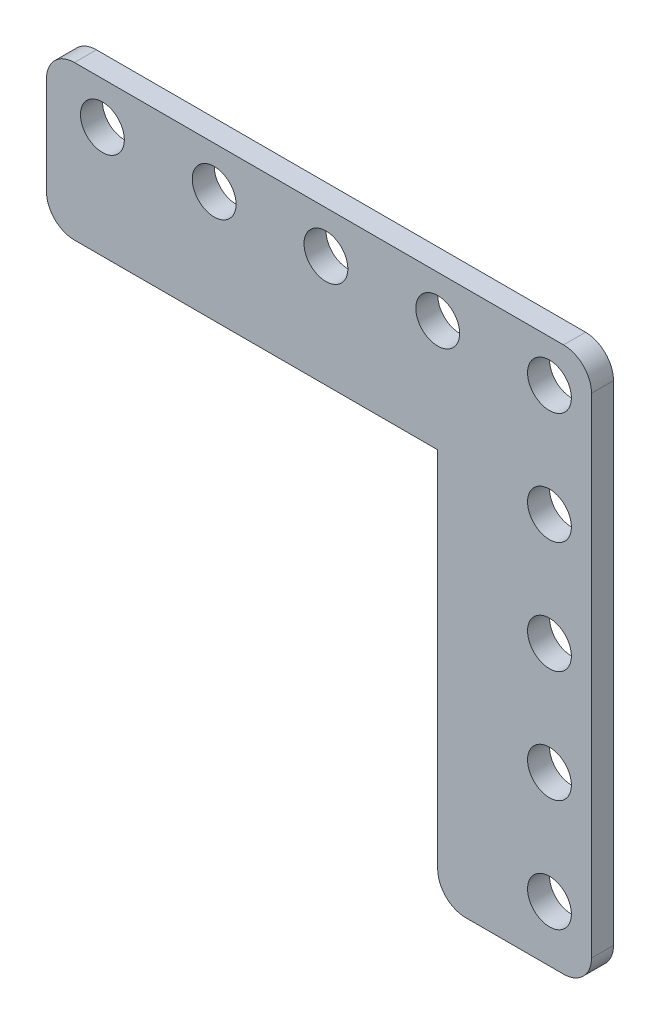
ISO-10303-21;
HEADER;
FILE_DESCRIPTION(('STEP AP214'),'2;1');
FILE_NAME('part.step','',(''),(''),'','','');
FILE_SCHEMA(('AUTOMOTIVE_DESIGN { 1 0 10303 214 1 1 1 1 }'));
ENDSEC;
DATA;
#1=APPLICATION_CONTEXT('core data for automotive mechanical design processes');
#2=APPLICATION_PROTOCOL_DEFINITION('international standard','automotive_design',2000,#1);
#3=PRODUCT_CONTEXT('',#1,'mechanical');
#4=PRODUCT('Part','Part','',(#3));
#5=PRODUCT_RELATED_PRODUCT_CATEGORY('part','',(#4));
#6=PRODUCT_DEFINITION_FORMATION('','',#4);
#7=PRODUCT_DEFINITION_CONTEXT('part definition',#1,'design');
#8=PRODUCT_DEFINITION('design','',#6,#7);
#9=PRODUCT_DEFINITION_SHAPE('','',#8);
#10=(LENGTH_UNIT() NAMED_UNIT(*) SI_UNIT(.MILLI.,.METRE.));
#11=(NAMED_UNIT(*) PLANE_ANGLE_UNIT() SI_UNIT($,.RADIAN.));
#12=(NAMED_UNIT(*) SI_UNIT($,.STERADIAN.) SOLID_ANGLE_UNIT());
#13=UNCERTAINTY_MEASURE_WITH_UNIT(LENGTH_MEASURE(1.E-05),#10,'distance_accuracy_value','');
#14=(GEOMETRIC_REPRESENTATION_CONTEXT(3) GLOBAL_UNCERTAINTY_ASSIGNED_CONTEXT((#13)) GLOBAL_UNIT_ASSIGNED_CONTEXT((#10,
#11,#12)) REPRESENTATION_CONTEXT('',''));
#15=CARTESIAN_POINT('',(0.,0.,0.));
#16=DIRECTION('',(0.,0.,1.));
#17=DIRECTION('',(1.,0.,0.));
#18=AXIS2_PLACEMENT_3D('',#15,#16,#17);
#19=CARTESIAN_POINT('',(-13.4873999999968,875.512599999967,2.50000000000015));
#20=DIRECTION('',(0.,0.,1.));
#21=DIRECTION('',(1.,0.,0.));
#22=AXIS2_PLACEMENT_3D('',#19,#20,#21);
#23=PLANE('',#22);
#24=CARTESIAN_POINT('',(-38.0999999999977,901.699999999967,2.50000000000015));
#25=DIRECTION('',(0.,0.,-1.));
#26=DIRECTION('',(1.,0.,0.));
#27=AXIS2_PLACEMENT_3D('',#24,#25,#26);
#28=CIRCLE('',#27,2.4892);
#29=CARTESIAN_POINT('',(-40.5891999999977,901.699999999967,2.50000000000015));
#30=VERTEX_POINT('',#29);
#31=EDGE_CURVE('E252',#30,#30,#28,.T.);
#32=ORIENTED_EDGE('',*,*,#31,.T.);
#33=EDGE_LOOP('',(#32));
#34=FACE_BOUND('',#33,.T.);
#35=CARTESIAN_POINT('',(12.7000000000032,901.699999999967,2.50000000000015));
#36=DIRECTION('',(0.,0.,-1.));
#37=DIRECTION('',(1.,0.,0.));
#38=AXIS2_PLACEMENT_3D('',#35,#36,#37);
#39=CIRCLE('',#38,2.4892);
#40=CARTESIAN_POINT('',(10.2108000000032,901.699999999967,2.50000000000015));
#41=VERTEX_POINT('',#40);
#42=EDGE_CURVE('E241',#41,#41,#39,.T.);
#43=ORIENTED_EDGE('',*,*,#42,.T.);
#44=EDGE_LOOP('',(#43));
#45=FACE_BOUND('',#44,.T.);
#46=CARTESIAN_POINT('',(12.700000000003,850.89999999997,2.50000000000015));
#47=DIRECTION('',(0.,0.,-1.));
#48=DIRECTION('',(1.,0.,0.));
#49=AXIS2_PLACEMENT_3D('',#46,#47,#48);
#50=CIRCLE('',#49,2.4892);
#51=CARTESIAN_POINT('',(10.210800000003,850.89999999997,2.50000000000015));
#52=VERTEX_POINT('',#51);
#53=EDGE_CURVE('E230',#52,#52,#50,.T.);
#54=ORIENTED_EDGE('',*,*,#53,.T.);
#55=EDGE_LOOP('',(#54));
#56=FACE_BOUND('',#55,.T.);
#57=CARTESIAN_POINT('',(12.7000000000032,888.999999999967,2.50000000000015));
#58=DIRECTION('',(0.,0.,-1.));
#59=DIRECTION('',(1.,0.,0.));
#60=AXIS2_PLACEMENT_3D('',#57,#58,#59);
#61=CIRCLE('',#60,2.4892);
#62=CARTESIAN_POINT('',(10.2108000000032,888.999999999967,2.50000000000015));
#63=VERTEX_POINT('',#62);
#64=EDGE_CURVE('E398',#63,#63,#61,.T.);
#65=ORIENTED_EDGE('',*,*,#64,.T.);
#66=EDGE_LOOP('',(#65));
#67=FACE_BOUND('',#66,.T.);
#68=CARTESIAN_POINT('',(-25.3999999999976,901.699999999967,2.50000000000015));
#69=DIRECTION('',(0.,0.,-1.));
#70=DIRECTION('',(1.,0.,0.));
#71=AXIS2_PLACEMENT_3D('',#68,#69,#70);
#72=CIRCLE('',#71,2.4892);
#73=CARTESIAN_POINT('',(-27.8891999999977,901.699999999967,2.50000000000015));
#74=VERTEX_POINT('',#73);
#75=EDGE_CURVE('E366',#74,#74,#72,.T.);
#76=ORIENTED_EDGE('',*,*,#75,.T.);
#77=EDGE_LOOP('',(#76));
#78=FACE_BOUND('',#77,.T.);
#79=CARTESIAN_POINT('',(3.29514193708748E-12,901.699999999967,2.50000000000015));
#80=DIRECTION('',(0.,0.,-1.));
#81=DIRECTION('',(1.,0.,0.));
#82=AXIS2_PLACEMENT_3D('',#79,#80,#81);
#83=CIRCLE('',#82,2.4892);
#84=CARTESIAN_POINT('',(-2.4891999999967,901.699999999967,2.50000000000015));
#85=VERTEX_POINT('',#84);
#86=EDGE_CURVE('E380',#85,#85,#83,.T.);
#87=ORIENTED_EDGE('',*,*,#86,.T.);
#88=EDGE_LOOP('',(#87));
#89=FACE_BOUND('',#88,.T.);
#90=CARTESIAN_POINT('',(12.7000000000031,863.59999999997,2.50000000000015));
#91=DIRECTION('',(0.,0.,-1.));
#92=DIRECTION('',(1.,0.,0.));
#93=AXIS2_PLACEMENT_3D('',#90,#91,#92);
#94=CIRCLE('',#93,2.4892);
#95=CARTESIAN_POINT('',(10.2108000000031,863.59999999997,2.50000000000015));
#96=VERTEX_POINT('',#95);
#97=EDGE_CURVE('E349',#96,#96,#94,.T.);
#98=ORIENTED_EDGE('',*,*,#97,.T.);
#99=EDGE_LOOP('',(#98));
#100=FACE_BOUND('',#99,.T.);
#101=CARTESIAN_POINT('',(12.7000000000031,876.299999999969,2.50000000000015));
#102=DIRECTION('',(0.,0.,-1.));
#103=DIRECTION('',(1.,0.,0.));
#104=AXIS2_PLACEMENT_3D('',#101,#102,#103);
#105=CIRCLE('',#104,2.4892);
#106=CARTESIAN_POINT('',(10.2108000000031,876.299999999969,2.50000000000015));
#107=VERTEX_POINT('',#106);
#108=EDGE_CURVE('E347',#107,#107,#105,.T.);
#109=ORIENTED_EDGE('',*,*,#108,.T.);
#110=EDGE_LOOP('',(#109));
#111=FACE_BOUND('',#110,.T.);
#112=CARTESIAN_POINT('',(-12.699999999997,901.699999999967,2.50000000000015));
#113=DIRECTION('',(0.,0.,-1.));
#114=DIRECTION('',(1.,0.,0.));
#115=AXIS2_PLACEMENT_3D('',#112,#113,#114);
#116=CIRCLE('',#115,2.4892);
#117=CARTESIAN_POINT('',(-15.189199999997,901.699999999967,2.50000000000015));
#118=VERTEX_POINT('',#117);
#119=EDGE_CURVE('E497',#118,#118,#116,.T.);
#120=ORIENTED_EDGE('',*,*,#119,.T.);
#121=EDGE_LOOP('',(#120));
#122=FACE_BOUND('',#121,.T.);
#123=CARTESIAN_POINT('',(14.3002000000032,847.724999999967,2.50000000000015));
#124=DIRECTION('',(0.,0.,-1.));
#125=DIRECTION('',(0.707106781186552,-0.707106781186543,0.));
#126=AXIS2_PLACEMENT_3D('',#123,#124,#125);
#127=CIRCLE('',#126,3.175);
#128=CARTESIAN_POINT('',(17.4752000000032,847.724999999967,2.50000000000015));
#129=VERTEX_POINT('',#128);
#130=CARTESIAN_POINT('',(14.3002000000032,844.549999999967,2.50000000000015));
#131=VERTEX_POINT('',#130);
#132=EDGE_CURVE('E279',#129,#131,#127,.T.);
#133=ORIENTED_EDGE('',*,*,#132,.F.);
#134=DIRECTION('',(0.,1.,0.));
#135=VECTOR('',#134,1.);
#136=CARTESIAN_POINT('',(17.4752000000032,844.549999999967,2.50000000000015));
#137=LINE('',#136,#135);
#138=CARTESIAN_POINT('',(17.4752000000032,903.300199999967,2.50000000000015));
#139=VERTEX_POINT('',#138);
#140=EDGE_CURVE('E198',#129,#139,#137,.T.);
#141=ORIENTED_EDGE('',*,*,#140,.T.);
#142=CARTESIAN_POINT('',(14.3002000000032,903.300199999967,2.50000000000015));
#143=DIRECTION('',(0.,0.,-1.));
#144=DIRECTION('',(0.707106781186552,0.707106781186543,0.));
#145=AXIS2_PLACEMENT_3D('',#142,#143,#144);
#146=CIRCLE('',#145,3.175);
#147=CARTESIAN_POINT('',(14.3002000000032,906.475199999967,2.50000000000015));
#148=VERTEX_POINT('',#147);
#149=EDGE_CURVE('E203',#148,#139,#146,.T.);
#150=ORIENTED_EDGE('',*,*,#149,.F.);
#151=DIRECTION('',(-1.,0.,0.));
#152=VECTOR('',#151,1.);
#153=CARTESIAN_POINT('',(17.4752000000032,906.475199999967,2.50000000000015));
#154=LINE('',#153,#152);
#155=CARTESIAN_POINT('',(-41.2749999999967,906.475199999967,2.50000000000015));
#156=VERTEX_POINT('',#155);
#157=EDGE_CURVE('E187',#148,#156,#154,.T.);
#158=ORIENTED_EDGE('',*,*,#157,.T.);
#159=CARTESIAN_POINT('',(-41.2749999999967,903.300199999967,2.50000000000015));
#160=DIRECTION('',(0.,0.,-1.));
#161=DIRECTION('',(-0.707106781186552,0.707106781186543,0.));
#162=AXIS2_PLACEMENT_3D('',#159,#160,#161);
#163=CIRCLE('',#162,3.175);
#164=CARTESIAN_POINT('',(-44.4499999999967,903.300199999967,2.50000000000015));
#165=VERTEX_POINT('',#164);
#166=EDGE_CURVE('E220',#165,#156,#163,.T.);
#167=ORIENTED_EDGE('',*,*,#166,.F.);
#168=DIRECTION('',(0.,-1.,0.));
#169=VECTOR('',#168,1.);
#170=CARTESIAN_POINT('',(-44.4499999999967,906.475199999967,2.50000000000015));
#171=LINE('',#170,#169);
#172=CARTESIAN_POINT('',(-44.4499999999967,892.174999999967,2.50000000000015));
#173=VERTEX_POINT('',#172);
#174=EDGE_CURVE('E324',#165,#173,#171,.T.);
#175=ORIENTED_EDGE('',*,*,#174,.T.);
#176=CARTESIAN_POINT('',(-41.2749999999967,892.174999999967,2.50000000000015));
#177=DIRECTION('',(0.,0.,-1.));
#178=DIRECTION('',(-0.707106781186552,-0.707106781186543,0.));
#179=AXIS2_PLACEMENT_3D('',#176,#177,#178);
#180=CIRCLE('',#179,3.175);
#181=CARTESIAN_POINT('',(-41.2749999999967,888.999999999967,2.50000000000015));
#182=VERTEX_POINT('',#181);
#183=EDGE_CURVE('E263',#182,#173,#180,.T.);
#184=ORIENTED_EDGE('',*,*,#183,.F.);
#185=DIRECTION('',(1.,0.,0.));
#186=VECTOR('',#185,1.);
#187=CARTESIAN_POINT('',(-44.4499999999967,888.999999999967,2.50000000000015));
#188=LINE('',#187,#186);
#189=CARTESIAN_POINT('',(3.22408766351145E-12,888.999999999967,2.50000000000015));
#190=VERTEX_POINT('',#189);
#191=EDGE_CURVE('E11',#182,#190,#188,.T.);
#192=ORIENTED_EDGE('',*,*,#191,.T.);
#193=DIRECTION('',(0.,-1.,0.));
#194=VECTOR('',#193,1.);
#195=CARTESIAN_POINT('',(3.22408766351145E-12,888.999999999967,2.50000000000015));
#196=LINE('',#195,#194);
#197=CARTESIAN_POINT('',(3.10656262619042E-12,847.724999999967,2.50000000000015));
#198=VERTEX_POINT('',#197);
#199=EDGE_CURVE('E197',#190,#198,#196,.T.);
#200=ORIENTED_EDGE('',*,*,#199,.T.);
#201=CARTESIAN_POINT('',(3.1750000000031,847.724999999967,2.50000000000015));
#202=DIRECTION('',(0.,0.,-1.));
#203=DIRECTION('',(-0.707106781186553,-0.707106781186542,0.));
#204=AXIS2_PLACEMENT_3D('',#201,#202,#203);
#205=CIRCLE('',#204,3.175);
#206=CARTESIAN_POINT('',(3.1750000000031,844.549999999967,2.50000000000015));
#207=VERTEX_POINT('',#206);
#208=EDGE_CURVE('E257',#207,#198,#205,.T.);
#209=ORIENTED_EDGE('',*,*,#208,.F.);
#210=DIRECTION('',(1.,0.,0.));
#211=VECTOR('',#210,1.);
#212=CARTESIAN_POINT('',(3.0975222387042E-12,844.549999999967,2.50000000000015));
#213=LINE('',#212,#211);
#214=EDGE_CURVE('E258',#207,#131,#213,.T.);
#215=ORIENTED_EDGE('',*,*,#214,.T.);
#216=EDGE_LOOP('',(#133,#141,#150,#158,#167,#175,#184,#192,#200,#209,#215));
#217=FACE_BOUND('',#216,.T.);
#218=ADVANCED_FACE('F17',(#34,#45,#56,#67,#78,#89,#100,#111,#122,#217),#23,.T.);
#219=CARTESIAN_POINT('',(-44.4499999999967,888.999999999967,1.53287466406063E-13));
#220=DIRECTION('',(0.,-1.,0.));
#221=DIRECTION('',(-1.,0.,0.));
#222=AXIS2_PLACEMENT_3D('',#219,#220,#221);
#223=PLANE('',#222);
#224=DIRECTION('',(0.,0.,1.));
#225=VECTOR('',#224,1.);
#226=CARTESIAN_POINT('',(-41.2749999999967,888.999999999967,1.53397238558369E-13));
#227=LINE('',#226,#225);
#228=CARTESIAN_POINT('',(-41.2749999999967,888.999999999967,1.5328673490841E-13));
#229=VERTEX_POINT('',#228);
#230=EDGE_CURVE('E320',#229,#182,#227,.T.);
#231=ORIENTED_EDGE('',*,*,#230,.F.);
#232=DIRECTION('',(1.,0.,0.));
#233=VECTOR('',#232,1.);
#234=CARTESIAN_POINT('',(-44.4499999999967,888.999999999967,1.53287466406063E-13));
#235=LINE('',#234,#233);
#236=CARTESIAN_POINT('',(3.22408766351145E-12,888.999999999967,1.53277225438917E-13));
#237=VERTEX_POINT('',#236);
#238=EDGE_CURVE('E297',#229,#237,#235,.T.);
#239=ORIENTED_EDGE('',*,*,#238,.T.);
#240=DIRECTION('',(0.,0.,1.));
#241=VECTOR('',#240,1.);
#242=CARTESIAN_POINT('',(3.22408766351145E-12,888.999999999967,1.53277225438917E-13));
#243=LINE('',#242,#241);
#244=EDGE_CURVE('E26',#237,#190,#243,.T.);
#245=ORIENTED_EDGE('',*,*,#244,.T.);
#246=ORIENTED_EDGE('',*,*,#191,.F.);
#247=EDGE_LOOP('',(#231,#239,#245,#246));
#248=FACE_BOUND('',#247,.T.);
#249=ADVANCED_FACE('F450',(#248),#223,.T.);
#250=CARTESIAN_POINT('',(3.22408766351145E-12,888.999999999967,1.53277225438917E-13));
#251=DIRECTION('',(-1.,0.,0.));
#252=DIRECTION('',(0.,0.,1.));
#253=AXIS2_PLACEMENT_3D('',#250,#251,#252);
#254=PLANE('',#253);
#255=DIRECTION('',(0.,0.,-1.));
#256=VECTOR('',#255,1.);
#257=CARTESIAN_POINT('',(3.1064040229012E-12,847.724999999967,1.52998008481745E-13));
#258=LINE('',#257,#256);
#259=CARTESIAN_POINT('',(3.10656262619042E-12,847.724999999967,1.52758679661312E-13));
#260=VERTEX_POINT('',#259);
#261=EDGE_CURVE('E268',#198,#260,#258,.T.);
#262=ORIENTED_EDGE('',*,*,#261,.F.);
#263=ORIENTED_EDGE('',*,*,#199,.F.);
#264=ORIENTED_EDGE('',*,*,#244,.F.);
#265=DIRECTION('',(0.,-1.,0.));
#266=VECTOR('',#265,1.);
#267=CARTESIAN_POINT('',(3.22408766351145E-12,888.999999999967,1.53277225438917E-13));
#268=LINE('',#267,#266);
#269=EDGE_CURVE('E273',#237,#260,#268,.T.);
#270=ORIENTED_EDGE('',*,*,#269,.T.);
#271=EDGE_LOOP('',(#262,#263,#264,#270));
#272=FACE_BOUND('',#271,.T.);
#273=ADVANCED_FACE('F449',(#272),#254,.T.);
#274=CARTESIAN_POINT('',(17.4752000000032,906.475199999967,1.53492743580445E-13));
#275=DIRECTION('',(0.,1.,0.));
#276=DIRECTION('',(1.,0.,0.));
#277=AXIS2_PLACEMENT_3D('',#274,#275,#276);
#278=PLANE('',#277);
#279=DIRECTION('',(0.,0.,-1.));
#280=VECTOR('',#279,1.);
#281=CARTESIAN_POINT('',(-41.2749999999967,906.475199999967,1.5349987714556E-13));
#282=LINE('',#281,#280);
#283=CARTESIAN_POINT('',(-41.2749999999967,906.475199999967,1.53506279213021E-13));
#284=VERTEX_POINT('',#283);
#285=EDGE_CURVE('E193',#156,#284,#282,.T.);
#286=ORIENTED_EDGE('',*,*,#285,.F.);
#287=ORIENTED_EDGE('',*,*,#157,.F.);
#288=DIRECTION('',(0.,0.,1.));
#289=VECTOR('',#288,1.);
#290=CARTESIAN_POINT('',(14.3002000000032,906.475199999967,1.53103754470967E-13));
#291=LINE('',#290,#289);
#292=CARTESIAN_POINT('',(14.3002000000032,906.475199999967,1.53493475078099E-13));
#293=VERTEX_POINT('',#292);
#294=EDGE_CURVE('E191',#293,#148,#291,.T.);
#295=ORIENTED_EDGE('',*,*,#294,.F.);
#296=DIRECTION('',(-1.,0.,0.));
#297=VECTOR('',#296,1.);
#298=CARTESIAN_POINT('',(17.4752000000032,906.475199999967,1.53492743580445E-13));
#299=LINE('',#298,#297);
#300=EDGE_CURVE('E307',#293,#284,#299,.T.);
#301=ORIENTED_EDGE('',*,*,#300,.T.);
#302=EDGE_LOOP('',(#286,#287,#295,#301));
#303=FACE_BOUND('',#302,.T.);
#304=ADVANCED_FACE('F189',(#303),#278,.T.);
#305=CARTESIAN_POINT('',(17.4752000000032,844.549999999967,1.52714765361489E-13));
#306=DIRECTION('',(1.,0.,0.));
#307=DIRECTION('',(0.,1.,0.));
#308=AXIS2_PLACEMENT_3D('',#305,#306,#307);
#309=PLANE('',#308);
#310=DIRECTION('',(0.,0.,1.));
#311=VECTOR('',#310,1.);
#312=CARTESIAN_POINT('',(17.4752000000032,847.724999999967,1.52716778443031E-13));
#313=LINE('',#312,#311);
#314=CARTESIAN_POINT('',(17.4752000000032,847.724999999967,1.52754653498228E-13));
#315=VERTEX_POINT('',#314);
#316=EDGE_CURVE('E288',#315,#129,#313,.T.);
#317=ORIENTED_EDGE('',*,*,#316,.F.);
#318=DIRECTION('',(0.,1.,0.));
#319=VECTOR('',#318,1.);
#320=CARTESIAN_POINT('',(17.4752000000032,844.549999999967,1.52714765361489E-13));
#321=LINE('',#320,#319);
#322=CARTESIAN_POINT('',(17.4752000000032,903.300199999967,1.53452855443706E-13));
#323=VERTEX_POINT('',#322);
#324=EDGE_CURVE('E312',#315,#323,#321,.T.);
#325=ORIENTED_EDGE('',*,*,#324,.T.);
#326=DIRECTION('',(0.,0.,-1.));
#327=VECTOR('',#326,1.);
#328=CARTESIAN_POINT('',(17.4752000000032,903.300199999967,1.53103754470967E-13));
#329=LINE('',#328,#327);
#330=EDGE_CURVE('E208',#139,#323,#329,.T.);
#331=ORIENTED_EDGE('',*,*,#330,.F.);
#332=ORIENTED_EDGE('',*,*,#140,.F.);
#333=EDGE_LOOP('',(#317,#325,#331,#332));
#334=FACE_BOUND('',#333,.T.);
#335=ADVANCED_FACE('F470',(#334),#309,.T.);
#336=CARTESIAN_POINT('',(14.3002000000032,903.300199999967,1.53103754470967E-13));
#337=DIRECTION('',(0.,0.,1.));
#338=DIRECTION('',(0.707106781186552,0.707106781186543,0.));
#339=AXIS2_PLACEMENT_3D('',#336,#337,#338);
#340=CYLINDRICAL_SURFACE('',#339,3.175);
#341=ORIENTED_EDGE('',*,*,#149,.T.);
#342=ORIENTED_EDGE('',*,*,#330,.T.);
#343=CARTESIAN_POINT('',(14.3002000000032,903.300199999967,1.53110888036082E-13));
#344=DIRECTION('',(0.,0.,1.));
#345=DIRECTION('',(0.707106781186552,0.707106781186543,0.));
#346=AXIS2_PLACEMENT_3D('',#343,#344,#345);
#347=CIRCLE('',#346,3.175);
#348=EDGE_CURVE('E205',#323,#293,#347,.T.);
#349=ORIENTED_EDGE('',*,*,#348,.T.);
#350=ORIENTED_EDGE('',*,*,#294,.T.);
#351=EDGE_LOOP('',(#341,#342,#349,#350));
#352=FACE_BOUND('',#351,.T.);
#353=ADVANCED_FACE('F202',(#352),#340,.T.);
#354=CARTESIAN_POINT('',(-41.2749999999967,903.300199999967,1.5349987714556E-13));
#355=DIRECTION('',(0.,0.,1.));
#356=DIRECTION('',(-0.707106781186552,0.707106781186543,0.));
#357=AXIS2_PLACEMENT_3D('',#354,#355,#356);
#358=CYLINDRICAL_SURFACE('',#357,3.175);
#359=ORIENTED_EDGE('',*,*,#166,.T.);
#360=ORIENTED_EDGE('',*,*,#285,.T.);
#361=CARTESIAN_POINT('',(-41.2749999999967,903.300199999967,1.53110888036082E-13));
#362=DIRECTION('',(0.,0.,1.));
#363=DIRECTION('',(-0.707106781186552,0.707106781186543,0.));
#364=AXIS2_PLACEMENT_3D('',#361,#362,#363);
#365=CIRCLE('',#364,3.175);
#366=CARTESIAN_POINT('',(-44.4499999999967,903.300199999967,1.53467122573935E-13));
#367=VERTEX_POINT('',#366);
#368=EDGE_CURVE('E302',#284,#367,#365,.T.);
#369=ORIENTED_EDGE('',*,*,#368,.T.);
#370=DIRECTION('',(0.,0.,1.));
#371=VECTOR('',#370,1.);
#372=CARTESIAN_POINT('',(-44.4499999999967,903.300199999967,1.5349987714556E-13));
#373=LINE('',#372,#371);
#374=EDGE_CURVE('E327',#367,#165,#373,.T.);
#375=ORIENTED_EDGE('',*,*,#374,.T.);
#376=EDGE_LOOP('',(#359,#360,#369,#375));
#377=FACE_BOUND('',#376,.T.);
#378=ADVANCED_FACE('F460',(#377),#358,.T.);
#379=CARTESIAN_POINT('',(-44.4499999999967,906.475199999967,1.53507010710674E-13));
#380=DIRECTION('',(-1.,0.,0.));
#381=DIRECTION('',(0.,0.,1.));
#382=AXIS2_PLACEMENT_3D('',#379,#380,#381);
#383=PLANE('',#382);
#384=DIRECTION('',(0.,0.,-1.));
#385=VECTOR('',#384,1.);
#386=CARTESIAN_POINT('',(-44.4499999999967,892.174999999967,1.53397238558369E-13));
#387=LINE('',#386,#385);
#388=CARTESIAN_POINT('',(-44.4499999999967,892.174999999967,1.53327354542802E-13));
#389=VERTEX_POINT('',#388);
#390=EDGE_CURVE('E267',#173,#389,#387,.T.);
#391=ORIENTED_EDGE('',*,*,#390,.F.);
#392=ORIENTED_EDGE('',*,*,#174,.F.);
#393=ORIENTED_EDGE('',*,*,#374,.F.);
#394=DIRECTION('',(0.,-1.,0.));
#395=VECTOR('',#394,1.);
#396=CARTESIAN_POINT('',(-44.4499999999967,906.475199999967,1.53507010710674E-13));
#397=LINE('',#396,#395);
#398=EDGE_CURVE('E298',#367,#389,#397,.T.);
#399=ORIENTED_EDGE('',*,*,#398,.T.);
#400=EDGE_LOOP('',(#391,#392,#393,#399));
#401=FACE_BOUND('',#400,.T.);
#402=ADVANCED_FACE('F457',(#401),#383,.T.);
#403=CARTESIAN_POINT('',(-41.2749999999967,892.174999999967,1.53397238558369E-13));
#404=DIRECTION('',(0.,0.,1.));
#405=DIRECTION('',(-0.707106781186552,-0.707106781186543,0.));
#406=AXIS2_PLACEMENT_3D('',#403,#404,#405);
#407=CYLINDRICAL_SURFACE('',#406,3.175);
#408=ORIENTED_EDGE('',*,*,#183,.T.);
#409=ORIENTED_EDGE('',*,*,#390,.T.);
#410=CARTESIAN_POINT('',(-41.2749999999967,892.174999999967,1.53110888036082E-13));
#411=DIRECTION('',(0.,0.,1.));
#412=DIRECTION('',(-0.707106781186552,-0.707106781186543,0.));
#413=AXIS2_PLACEMENT_3D('',#410,#411,#412);
#414=CIRCLE('',#413,3.175);
#415=EDGE_CURVE('E303',#389,#229,#414,.T.);
#416=ORIENTED_EDGE('',*,*,#415,.T.);
#417=ORIENTED_EDGE('',*,*,#230,.T.);
#418=EDGE_LOOP('',(#408,#409,#416,#417));
#419=FACE_BOUND('',#418,.T.);
#420=ADVANCED_FACE('F452',(#419),#407,.T.);
#421=CARTESIAN_POINT('',(3.1750000000031,847.724999999967,1.52998008481745E-13));
#422=DIRECTION('',(0.,0.,1.));
#423=DIRECTION('',(-0.707106781186553,-0.707106781186542,0.));
#424=AXIS2_PLACEMENT_3D('',#421,#422,#423);
#425=CYLINDRICAL_SURFACE('',#424,3.175);
#426=ORIENTED_EDGE('',*,*,#208,.T.);
#427=ORIENTED_EDGE('',*,*,#261,.T.);
#428=CARTESIAN_POINT('',(3.1750000000031,847.724999999967,1.53110888036082E-13));
#429=DIRECTION('',(0.,0.,1.));
#430=DIRECTION('',(-0.707106781186553,-0.707106781186542,0.));
#431=AXIS2_PLACEMENT_3D('',#428,#429,#430);
#432=CIRCLE('',#431,3.175);
#433=CARTESIAN_POINT('',(3.1750000000031,844.549999999967,1.52718060026919E-13));
#434=VERTEX_POINT('',#433);
#435=EDGE_CURVE('E269',#260,#434,#432,.T.);
#436=ORIENTED_EDGE('',*,*,#435,.T.);
#437=DIRECTION('',(0.,0.,1.));
#438=VECTOR('',#437,1.);
#439=CARTESIAN_POINT('',(3.1750000000031,844.549999999967,1.52998008481745E-13));
#440=LINE('',#439,#438);
#441=EDGE_CURVE('E253',#434,#207,#440,.T.);
#442=ORIENTED_EDGE('',*,*,#441,.T.);
#443=EDGE_LOOP('',(#426,#427,#436,#442));
#444=FACE_BOUND('',#443,.T.);
#445=ADVANCED_FACE('F444',(#444),#425,.T.);
#446=CARTESIAN_POINT('',(3.0975222387042E-12,844.549999999967,1.52718791524573E-13));
#447=DIRECTION('',(0.,-1.,0.));
#448=DIRECTION('',(0.,0.,-1.));
#449=AXIS2_PLACEMENT_3D('',#446,#447,#448);
#450=PLANE('',#449);
#451=DIRECTION('',(0.,0.,-1.));
#452=VECTOR('',#451,1.);
#453=CARTESIAN_POINT('',(14.3002000000032,844.549999999967,1.52716778443031E-13));
#454=LINE('',#453,#452);
#455=CARTESIAN_POINT('',(14.3002000000032,844.549999999967,1.52715496859142E-13));
#456=VERTEX_POINT('',#455);
#457=EDGE_CURVE('E283',#131,#456,#454,.T.);
#458=ORIENTED_EDGE('',*,*,#457,.F.);
#459=ORIENTED_EDGE('',*,*,#214,.F.);
#460=ORIENTED_EDGE('',*,*,#441,.F.);
#461=DIRECTION('',(1.,0.,0.));
#462=VECTOR('',#461,1.);
#463=CARTESIAN_POINT('',(3.0975222387042E-12,844.549999999967,1.52718791524573E-13));
#464=LINE('',#463,#462);
#465=EDGE_CURVE('E274',#434,#456,#464,.T.);
#466=ORIENTED_EDGE('',*,*,#465,.T.);
#467=EDGE_LOOP('',(#458,#459,#460,#466));
#468=FACE_BOUND('',#467,.T.);
#469=ADVANCED_FACE('F419',(#468),#450,.T.);
#470=CARTESIAN_POINT('',(-13.4873999999968,875.512599999967,1.53110888036082E-13));
#471=DIRECTION('',(0.,0.,1.));
#472=DIRECTION('',(0.,-1.,0.));
#473=AXIS2_PLACEMENT_3D('',#470,#471,#472);
#474=PLANE('',#473);
#475=CARTESIAN_POINT('',(-38.0999999999977,901.699999999967,1.53210777398272E-13));
#476=DIRECTION('',(0.,0.,1.));
#477=DIRECTION('',(1.,0.,0.));
#478=AXIS2_PLACEMENT_3D('',#475,#476,#477);
#479=CIRCLE('',#478,2.4892);
#480=CARTESIAN_POINT('',(-40.5891999999977,901.699999999967,1.53210777398272E-13));
#481=VERTEX_POINT('',#480);
#482=EDGE_CURVE('E278',#481,#481,#479,.T.);
#483=ORIENTED_EDGE('',*,*,#482,.T.);
#484=EDGE_LOOP('',(#483));
#485=FACE_BOUND('',#484,.T.);
#486=CARTESIAN_POINT('',(12.7000000000032,901.699999999967,1.53210777398272E-13));
#487=DIRECTION('',(0.,0.,1.));
#488=DIRECTION('',(1.,0.,0.));
#489=AXIS2_PLACEMENT_3D('',#486,#487,#488);
#490=CIRCLE('',#489,2.4892);
#491=CARTESIAN_POINT('',(10.2108000000032,901.699999999967,1.53210777398272E-13));
#492=VERTEX_POINT('',#491);
#493=EDGE_CURVE('E249',#492,#492,#490,.T.);
#494=ORIENTED_EDGE('',*,*,#493,.T.);
#495=EDGE_LOOP('',(#494));
#496=FACE_BOUND('',#495,.T.);
#497=CARTESIAN_POINT('',(12.700000000003,850.89999999997,1.53210777398272E-13));
#498=DIRECTION('',(0.,0.,1.));
#499=DIRECTION('',(1.,0.,0.));
#500=AXIS2_PLACEMENT_3D('',#497,#498,#499);
#501=CIRCLE('',#500,2.4892);
#502=CARTESIAN_POINT('',(10.210800000003,850.89999999997,1.53210777398272E-13));
#503=VERTEX_POINT('',#502);
#504=EDGE_CURVE('E238',#503,#503,#501,.T.);
#505=ORIENTED_EDGE('',*,*,#504,.T.);
#506=EDGE_LOOP('',(#505));
#507=FACE_BOUND('',#506,.T.);
#508=CARTESIAN_POINT('',(12.7000000000032,888.999999999967,1.53210777398272E-13));
#509=DIRECTION('',(0.,0.,1.));
#510=DIRECTION('',(1.,0.,0.));
#511=AXIS2_PLACEMENT_3D('',#508,#509,#510);
#512=CIRCLE('',#511,2.4892);
#513=CARTESIAN_POINT('',(10.2108000000032,888.999999999967,1.53210777398272E-13));
#514=VERTEX_POINT('',#513);
#515=EDGE_CURVE('E226',#514,#514,#512,.T.);
#516=ORIENTED_EDGE('',*,*,#515,.T.);
#517=EDGE_LOOP('',(#516));
#518=FACE_BOUND('',#517,.T.);
#519=CARTESIAN_POINT('',(-25.3999999999976,901.699999999967,1.53210777398272E-13));
#520=DIRECTION('',(0.,0.,1.));
#521=DIRECTION('',(1.,0.,0.));
#522=AXIS2_PLACEMENT_3D('',#519,#520,#521);
#523=CIRCLE('',#522,2.4892);
#524=CARTESIAN_POINT('',(-27.8891999999977,901.699999999967,1.53210777398272E-13));
#525=VERTEX_POINT('',#524);
#526=EDGE_CURVE('E396',#525,#525,#523,.T.);
#527=ORIENTED_EDGE('',*,*,#526,.T.);
#528=EDGE_LOOP('',(#527));
#529=FACE_BOUND('',#528,.T.);
#530=CARTESIAN_POINT('',(3.29514193708748E-12,901.699999999967,1.53210777398272E-13));
#531=DIRECTION('',(0.,0.,1.));
#532=DIRECTION('',(1.,0.,0.));
#533=AXIS2_PLACEMENT_3D('',#530,#531,#532);
#534=CIRCLE('',#533,2.4892);
#535=CARTESIAN_POINT('',(-2.4891999999967,901.699999999967,1.53210777398272E-13));
#536=VERTEX_POINT('',#535);
#537=EDGE_CURVE('E371',#536,#536,#534,.T.);
#538=ORIENTED_EDGE('',*,*,#537,.T.);
#539=EDGE_LOOP('',(#538));
#540=FACE_BOUND('',#539,.T.);
#541=CARTESIAN_POINT('',(12.7000000000031,863.59999999997,1.53210777398272E-13));
#542=DIRECTION('',(0.,0.,1.));
#543=DIRECTION('',(1.,0.,0.));
#544=AXIS2_PLACEMENT_3D('',#541,#542,#543);
#545=CIRCLE('',#544,2.4892);
#546=CARTESIAN_POINT('',(10.2108000000031,863.59999999997,1.53210777398272E-13));
#547=VERTEX_POINT('',#546);
#548=EDGE_CURVE('E375',#547,#547,#545,.T.);
#549=ORIENTED_EDGE('',*,*,#548,.T.);
#550=EDGE_LOOP('',(#549));
#551=FACE_BOUND('',#550,.T.);
#552=CARTESIAN_POINT('',(12.7000000000031,876.299999999969,1.53210777398272E-13));
#553=DIRECTION('',(0.,0.,1.));
#554=DIRECTION('',(1.,0.,0.));
#555=AXIS2_PLACEMENT_3D('',#552,#553,#554);
#556=CIRCLE('',#555,2.4892);
#557=CARTESIAN_POINT('',(10.2108000000031,876.299999999969,1.53210777398272E-13));
#558=VERTEX_POINT('',#557);
#559=EDGE_CURVE('E354',#558,#558,#556,.T.);
#560=ORIENTED_EDGE('',*,*,#559,.T.);
#561=EDGE_LOOP('',(#560));
#562=FACE_BOUND('',#561,.T.);
#563=CARTESIAN_POINT('',(-12.699999999997,901.699999999967,1.53210777398272E-13));
#564=DIRECTION('',(0.,0.,1.));
#565=DIRECTION('',(1.,0.,0.));
#566=AXIS2_PLACEMENT_3D('',#563,#564,#565);
#567=CIRCLE('',#566,2.4892);
#568=CARTESIAN_POINT('',(-15.189199999997,901.699999999967,1.53210777398272E-13));
#569=VERTEX_POINT('',#568);
#570=EDGE_CURVE('E432',#569,#569,#567,.T.);
#571=ORIENTED_EDGE('',*,*,#570,.T.);
#572=EDGE_LOOP('',(#571));
#573=FACE_BOUND('',#572,.T.);
#574=CARTESIAN_POINT('',(14.3002000000032,847.724999999967,1.53110888036082E-13));
#575=DIRECTION('',(0.,0.,1.));
#576=DIRECTION('',(0.707106781186552,-0.707106781186543,0.));
#577=AXIS2_PLACEMENT_3D('',#574,#575,#576);
#578=CIRCLE('',#577,3.175);
#579=EDGE_CURVE('E287',#456,#315,#578,.T.);
#580=ORIENTED_EDGE('',*,*,#579,.F.);
#581=ORIENTED_EDGE('',*,*,#465,.F.);
#582=ORIENTED_EDGE('',*,*,#435,.F.);
#583=ORIENTED_EDGE('',*,*,#269,.F.);
#584=ORIENTED_EDGE('',*,*,#238,.F.);
#585=ORIENTED_EDGE('',*,*,#415,.F.);
#586=ORIENTED_EDGE('',*,*,#398,.F.);
#587=ORIENTED_EDGE('',*,*,#368,.F.);
#588=ORIENTED_EDGE('',*,*,#300,.F.);
#589=ORIENTED_EDGE('',*,*,#348,.F.);
#590=ORIENTED_EDGE('',*,*,#324,.F.);
#591=EDGE_LOOP('',(#580,#581,#582,#583,#584,#585,#586,#587,#588,#589,#590));
#592=FACE_BOUND('',#591,.T.);
#593=ADVANCED_FACE('F415',(#485,#496,#507,#518,#529,#540,#551,#562,#573,#592),#474,.F.);
#594=CARTESIAN_POINT('',(14.3002000000032,847.724999999967,1.52716778443031E-13));
#595=DIRECTION('',(0.,0.,1.));
#596=DIRECTION('',(0.707106781186552,-0.707106781186543,0.));
#597=AXIS2_PLACEMENT_3D('',#594,#595,#596);
#598=CYLINDRICAL_SURFACE('',#597,3.175);
#599=ORIENTED_EDGE('',*,*,#132,.T.);
#600=ORIENTED_EDGE('',*,*,#457,.T.);
#601=ORIENTED_EDGE('',*,*,#579,.T.);
#602=ORIENTED_EDGE('',*,*,#316,.T.);
#603=EDGE_LOOP('',(#599,#600,#601,#602));
#604=FACE_BOUND('',#603,.T.);
#605=ADVANCED_FACE('F418',(#604),#598,.T.);
#606=CARTESIAN_POINT('',(-38.0999999999977,901.699999999967,2.50000000000015));
#607=DIRECTION('',(0.,0.,-1.));
#608=DIRECTION('',(1.,0.,0.));
#609=AXIS2_PLACEMENT_3D('',#606,#607,#608);
#610=CYLINDRICAL_SURFACE('',#609,2.4892);
#611=ORIENTED_EDGE('',*,*,#31,.F.);
#612=DIRECTION('',(0.,0.,-1.));
#613=VECTOR('',#612,1.);
#614=CARTESIAN_POINT('',(-40.5891999999977,901.699999999967,2.50000000000015));
#615=LINE('',#614,#613);
#616=EDGE_CURVE('E261',#30,#481,#615,.T.);
#617=ORIENTED_EDGE('',*,*,#616,.T.);
#618=ORIENTED_EDGE('',*,*,#482,.F.);
#619=ORIENTED_EDGE('',*,*,#616,.F.);
#620=EDGE_LOOP('',(#611,#617,#618,#619));
#621=FACE_BOUND('',#620,.T.);
#622=ADVANCED_FACE('F724',(#621),#610,.F.);
#623=CARTESIAN_POINT('',(12.7000000000032,901.699999999967,2.50000000000015));
#624=DIRECTION('',(0.,0.,-1.));
#625=DIRECTION('',(1.,0.,0.));
#626=AXIS2_PLACEMENT_3D('',#623,#624,#625);
#627=CYLINDRICAL_SURFACE('',#626,2.4892);
#628=ORIENTED_EDGE('',*,*,#42,.F.);
#629=DIRECTION('',(0.,0.,-1.));
#630=VECTOR('',#629,1.);
#631=CARTESIAN_POINT('',(10.2108000000032,901.699999999967,2.50000000000015));
#632=LINE('',#631,#630);
#633=EDGE_CURVE('E245',#41,#492,#632,.T.);
#634=ORIENTED_EDGE('',*,*,#633,.T.);
#635=ORIENTED_EDGE('',*,*,#493,.F.);
#636=ORIENTED_EDGE('',*,*,#633,.F.);
#637=EDGE_LOOP('',(#628,#634,#635,#636));
#638=FACE_BOUND('',#637,.T.);
#639=ADVANCED_FACE('F718',(#638),#627,.F.);
#640=CARTESIAN_POINT('',(12.700000000003,850.89999999997,2.50000000000015));
#641=DIRECTION('',(0.,0.,-1.));
#642=DIRECTION('',(1.,0.,0.));
#643=AXIS2_PLACEMENT_3D('',#640,#641,#642);
#644=CYLINDRICAL_SURFACE('',#643,2.4892);
#645=ORIENTED_EDGE('',*,*,#53,.F.);
#646=DIRECTION('',(0.,0.,-1.));
#647=VECTOR('',#646,1.);
#648=CARTESIAN_POINT('',(10.210800000003,850.89999999997,2.50000000000015));
#649=LINE('',#648,#647);
#650=EDGE_CURVE('E234',#52,#503,#649,.T.);
#651=ORIENTED_EDGE('',*,*,#650,.T.);
#652=ORIENTED_EDGE('',*,*,#504,.F.);
#653=ORIENTED_EDGE('',*,*,#650,.F.);
#654=EDGE_LOOP('',(#645,#651,#652,#653));
#655=FACE_BOUND('',#654,.T.);
#656=ADVANCED_FACE('F723',(#655),#644,.F.);
#657=CARTESIAN_POINT('',(12.7000000000032,888.999999999967,2.50000000000015));
#658=DIRECTION('',(0.,0.,-1.));
#659=DIRECTION('',(1.,0.,0.));
#660=AXIS2_PLACEMENT_3D('',#657,#658,#659);
#661=CYLINDRICAL_SURFACE('',#660,2.4892);
#662=ORIENTED_EDGE('',*,*,#64,.F.);
#663=DIRECTION('',(0.,0.,-1.));
#664=VECTOR('',#663,1.);
#665=CARTESIAN_POINT('',(10.2108000000032,888.999999999967,2.50000000000015));
#666=LINE('',#665,#664);
#667=EDGE_CURVE('E224',#63,#514,#666,.T.);
#668=ORIENTED_EDGE('',*,*,#667,.T.);
#669=ORIENTED_EDGE('',*,*,#515,.F.);
#670=ORIENTED_EDGE('',*,*,#667,.F.);
#671=EDGE_LOOP('',(#662,#668,#669,#670));
#672=FACE_BOUND('',#671,.T.);
#673=ADVANCED_FACE('F411',(#672),#661,.F.);
#674=CARTESIAN_POINT('',(-25.3999999999976,901.699999999967,2.50000000000015));
#675=DIRECTION('',(0.,0.,-1.));
#676=DIRECTION('',(1.,0.,0.));
#677=AXIS2_PLACEMENT_3D('',#674,#675,#676);
#678=CYLINDRICAL_SURFACE('',#677,2.4892);
#679=ORIENTED_EDGE('',*,*,#75,.F.);
#680=DIRECTION('',(0.,0.,-1.));
#681=VECTOR('',#680,1.);
#682=CARTESIAN_POINT('',(-27.8891999999977,901.699999999967,2.50000000000015));
#683=LINE('',#682,#681);
#684=EDGE_CURVE('E370',#74,#525,#683,.T.);
#685=ORIENTED_EDGE('',*,*,#684,.T.);
#686=ORIENTED_EDGE('',*,*,#526,.F.);
#687=ORIENTED_EDGE('',*,*,#684,.F.);
#688=EDGE_LOOP('',(#679,#685,#686,#687));
#689=FACE_BOUND('',#688,.T.);
#690=ADVANCED_FACE('F704',(#689),#678,.F.);
#691=CARTESIAN_POINT('',(3.29514193708748E-12,901.699999999967,2.50000000000015));
#692=DIRECTION('',(0.,0.,-1.));
#693=DIRECTION('',(1.,0.,0.));
#694=AXIS2_PLACEMENT_3D('',#691,#692,#693);
#695=CYLINDRICAL_SURFACE('',#694,2.4892);
#696=ORIENTED_EDGE('',*,*,#86,.F.);
#697=DIRECTION('',(0.,0.,-1.));
#698=VECTOR('',#697,1.);
#699=CARTESIAN_POINT('',(-2.4891999999967,901.699999999967,2.50000000000015));
#700=LINE('',#699,#698);
#701=EDGE_CURVE('E384',#85,#536,#700,.T.);
#702=ORIENTED_EDGE('',*,*,#701,.T.);
#703=ORIENTED_EDGE('',*,*,#537,.F.);
#704=ORIENTED_EDGE('',*,*,#701,.F.);
#705=EDGE_LOOP('',(#696,#702,#703,#704));
#706=FACE_BOUND('',#705,.T.);
#707=ADVANCED_FACE('F695',(#706),#695,.F.);
#708=CARTESIAN_POINT('',(12.7000000000031,863.59999999997,2.50000000000015));
#709=DIRECTION('',(0.,0.,-1.));
#710=DIRECTION('',(1.,0.,0.));
#711=AXIS2_PLACEMENT_3D('',#708,#709,#710);
#712=CYLINDRICAL_SURFACE('',#711,2.4892);
#713=ORIENTED_EDGE('',*,*,#97,.F.);
#714=DIRECTION('',(0.,0.,-1.));
#715=VECTOR('',#714,1.);
#716=CARTESIAN_POINT('',(10.2108000000031,863.59999999997,2.50000000000015));
#717=LINE('',#716,#715);
#718=EDGE_CURVE('E353',#96,#547,#717,.T.);
#719=ORIENTED_EDGE('',*,*,#718,.T.);
#720=ORIENTED_EDGE('',*,*,#548,.F.);
#721=ORIENTED_EDGE('',*,*,#718,.F.);
#722=EDGE_LOOP('',(#713,#719,#720,#721));
#723=FACE_BOUND('',#722,.T.);
#724=ADVANCED_FACE('F686',(#723),#712,.F.);
#725=CARTESIAN_POINT('',(12.7000000000031,876.299999999969,2.50000000000015));
#726=DIRECTION('',(0.,0.,-1.));
#727=DIRECTION('',(1.,0.,0.));
#728=AXIS2_PLACEMENT_3D('',#725,#726,#727);
#729=CYLINDRICAL_SURFACE('',#728,2.4892);
#730=ORIENTED_EDGE('',*,*,#108,.F.);
#731=DIRECTION('',(0.,0.,-1.));
#732=VECTOR('',#731,1.);
#733=CARTESIAN_POINT('',(10.2108000000031,876.299999999969,2.50000000000015));
#734=LINE('',#733,#732);
#735=EDGE_CURVE('E355',#107,#558,#734,.T.);
#736=ORIENTED_EDGE('',*,*,#735,.T.);
#737=ORIENTED_EDGE('',*,*,#559,.F.);
#738=ORIENTED_EDGE('',*,*,#735,.F.);
#739=EDGE_LOOP('',(#730,#736,#737,#738));
#740=FACE_BOUND('',#739,.T.);
#741=ADVANCED_FACE('F678',(#740),#729,.F.);
#742=CARTESIAN_POINT('',(-12.699999999997,901.699999999967,2.50000000000015));
#743=DIRECTION('',(0.,0.,-1.));
#744=DIRECTION('',(1.,0.,0.));
#745=AXIS2_PLACEMENT_3D('',#742,#743,#744);
#746=CYLINDRICAL_SURFACE('',#745,2.4892);
#747=ORIENTED_EDGE('',*,*,#119,.F.);
#748=DIRECTION('',(0.,0.,-1.));
#749=VECTOR('',#748,1.);
#750=CARTESIAN_POINT('',(-15.189199999997,901.699999999967,2.50000000000015));
#751=LINE('',#750,#749);
#752=EDGE_CURVE('E502',#118,#569,#751,.T.);
#753=ORIENTED_EDGE('',*,*,#752,.T.);
#754=ORIENTED_EDGE('',*,*,#570,.F.);
#755=ORIENTED_EDGE('',*,*,#752,.F.);
#756=EDGE_LOOP('',(#747,#753,#754,#755));
#757=FACE_BOUND('',#756,.T.);
#758=ADVANCED_FACE('F674',(#757),#746,.F.);
#759=CLOSED_SHELL('',(#218,#249,#273,#304,#335,#353,#378,#402,#420,#445,#469,#593,#605,#622,
#639,#656,#673,#690,#707,#724,#741,#758));
#760=MANIFOLD_SOLID_BREP('B1',#759);
#761=ADVANCED_BREP_SHAPE_REPRESENTATION('',(#18,#760),#14);
#762=SHAPE_DEFINITION_REPRESENTATION(#9,#761);
ENDSEC;
END-ISO-10303-21;
